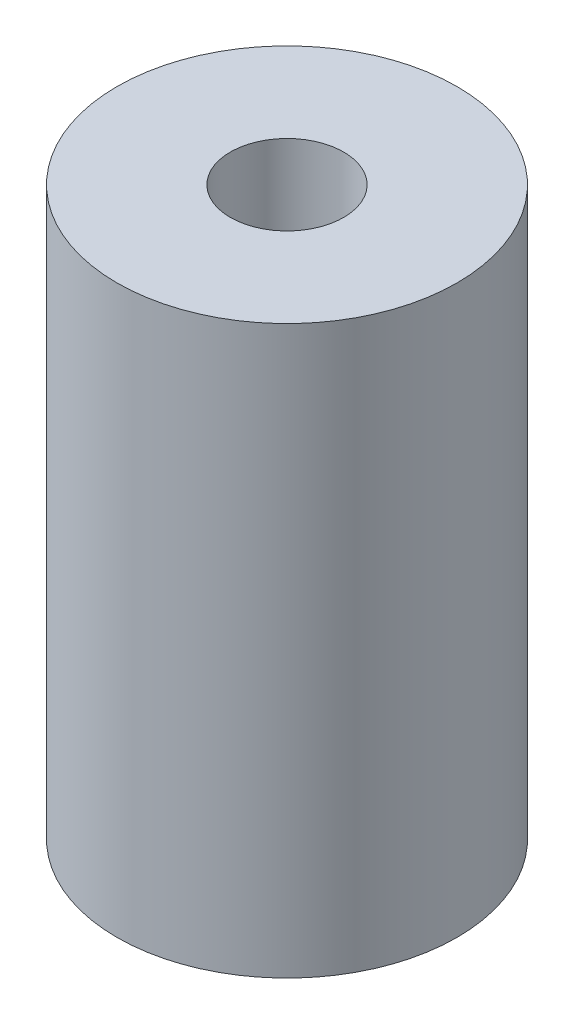
ISO-10303-21;
HEADER;
FILE_DESCRIPTION(('STEP AP214'),'2;1');
FILE_NAME('part.step','',(''),(''),'','','');
FILE_SCHEMA(('AUTOMOTIVE_DESIGN { 1 0 10303 214 1 1 1 1 }'));
ENDSEC;
DATA;
#1=APPLICATION_CONTEXT('core data for automotive mechanical design processes');
#2=APPLICATION_PROTOCOL_DEFINITION('international standard','automotive_design',2000,#1);
#3=PRODUCT_CONTEXT('',#1,'mechanical');
#4=PRODUCT('Part','Part','',(#3));
#5=PRODUCT_RELATED_PRODUCT_CATEGORY('part','',(#4));
#6=PRODUCT_DEFINITION_FORMATION('','',#4);
#7=PRODUCT_DEFINITION_CONTEXT('part definition',#1,'design');
#8=PRODUCT_DEFINITION('design','',#6,#7);
#9=PRODUCT_DEFINITION_SHAPE('','',#8);
#10=(LENGTH_UNIT() NAMED_UNIT(*) SI_UNIT(.MILLI.,.METRE.));
#11=(NAMED_UNIT(*) PLANE_ANGLE_UNIT() SI_UNIT($,.RADIAN.));
#12=(NAMED_UNIT(*) SI_UNIT($,.STERADIAN.) SOLID_ANGLE_UNIT());
#13=UNCERTAINTY_MEASURE_WITH_UNIT(LENGTH_MEASURE(1.E-05),#10,'distance_accuracy_value','');
#14=(GEOMETRIC_REPRESENTATION_CONTEXT(3) GLOBAL_UNCERTAINTY_ASSIGNED_CONTEXT((#13)) GLOBAL_UNIT_ASSIGNED_CONTEXT((#10,
#11,#12)) REPRESENTATION_CONTEXT('',''));
#15=CARTESIAN_POINT('',(0.,0.,0.));
#16=DIRECTION('',(0.,0.,1.));
#17=DIRECTION('',(1.,0.,0.));
#18=AXIS2_PLACEMENT_3D('',#15,#16,#17);
#19=CARTESIAN_POINT('',(0.,50.,0.));
#20=DIRECTION('',(0.,-1.,0.));
#21=DIRECTION('',(0.,0.,-1.));
#22=AXIS2_PLACEMENT_3D('',#19,#20,#21);
#23=CYLINDRICAL_SURFACE('',#22,15.);
#24=CARTESIAN_POINT('',(-14.142135623731,25.,5.));
#25=CARTESIAN_POINT('',(-14.1421347265217,24.7276591258196,5.00000128973856));
#26=CARTESIAN_POINT('',(-14.1500884645429,24.455326000882,4.97767391842761));
#27=CARTESIAN_POINT('',(-14.1808787040628,23.9187278950288,4.88925565844404));
#28=CARTESIAN_POINT('',(-14.2037176571094,23.6544642506377,4.82315756084198));
#29=CARTESIAN_POINT('',(-14.2614101844396,23.1418655350136,4.64977742842452));
#30=CARTESIAN_POINT('',(-14.2962401985661,22.8935003527864,4.54257610701622));
#31=CARTESIAN_POINT('',(-14.3739561005162,22.4181997572602,4.2903081422069));
#32=CARTESIAN_POINT('',(-14.4168437651806,22.1912690872318,4.14523314430091));
#33=CARTESIAN_POINT('',(-14.5077244703737,21.7564001883084,3.81525573221439));
#34=CARTESIAN_POINT('',(-14.5558447422322,21.5494228566414,3.62912170688959));
#35=CARTESIAN_POINT('',(-14.6506932400502,21.1689659938768,3.22493833607197));
#36=CARTESIAN_POINT('',(-14.6974212414481,20.9954918420882,3.00688387526187));
#37=CARTESIAN_POINT('',(-14.78569334609,20.682605513352,2.53802253982504));
#38=CARTESIAN_POINT('',(-14.8270703850803,20.5442001469102,2.28650955612262));
#39=CARTESIAN_POINT('',(-14.8984793385492,20.3120420743625,1.76215611493736));
#40=CARTESIAN_POINT('',(-14.9285143101501,20.2182773341155,1.48932142843605));
#41=CARTESIAN_POINT('',(-14.9729537715953,20.081320726838,0.940144087167467));
#42=CARTESIAN_POINT('',(-14.987865738878,20.036482768715,0.664253774264838));
#43=CARTESIAN_POINT('',(-15.0021804109124,19.9934185331967,0.108489374120443));
#44=CARTESIAN_POINT('',(-15.0015871131448,19.9951802417379,-0.171383667719486));
#45=CARTESIAN_POINT('',(-14.9853019809366,20.0442212728301,-0.715517575969077));
#46=CARTESIAN_POINT('',(-14.9702032377559,20.0897126423724,-0.979960242958287));
#47=CARTESIAN_POINT('',(-14.9273483669866,20.2219649049024,-1.49721719411086));
#48=CARTESIAN_POINT('',(-14.8995913815591,20.3087285948991,-1.75003068889608));
#49=CARTESIAN_POINT('',(-14.8337835146612,20.5221065865303,-2.24076237420987));
#50=CARTESIAN_POINT('',(-14.7956021262008,20.6492296927326,-2.47844110484423));
#51=CARTESIAN_POINT('',(-14.712919651946,20.9392985272433,-2.92962162763662));
#52=CARTESIAN_POINT('',(-14.6684168100733,21.1022542166382,-3.14311667192671));
#53=CARTESIAN_POINT('',(-14.5753095924948,21.4683719672985,-3.55050433275654));
#54=CARTESIAN_POINT('',(-14.5266107584439,21.6730657892074,-3.74300078532636));
#55=CARTESIAN_POINT('',(-14.432366762445,22.1122436286331,-4.09138629799087));
#56=CARTESIAN_POINT('',(-14.3868220872808,22.3467322286402,-4.24726971640772));
#57=CARTESIAN_POINT('',(-14.3035262560556,22.8432681280172,-4.51993727517872));
#58=CARTESIAN_POINT('',(-14.2658954642374,23.1056606565889,-4.6361323181067));
#59=CARTESIAN_POINT('',(-14.2040825412192,23.6478569710721,-4.82221596634669));
#60=CARTESIAN_POINT('',(-14.1798947743546,23.9276534060312,-4.89212397873747));
#61=CARTESIAN_POINT('',(-14.1489818157793,24.4831917770579,-4.98080641048761));
#62=CARTESIAN_POINT('',(-14.1415180159378,24.7585471237433,-5.00174547753817));
#63=CARTESIAN_POINT('',(-14.1428336029592,25.3088807455705,-4.9980271945486));
#64=CARTESIAN_POINT('',(-14.1516100395907,25.58385908012,-4.97337812613382));
#65=CARTESIAN_POINT('',(-14.183680904515,26.1157848285596,-4.88112825776155));
#66=CARTESIAN_POINT('',(-14.206466272042,26.3730271507542,-4.81503196990342));
#67=CARTESIAN_POINT('',(-14.2634276835512,26.8727180311959,-4.64356931280234));
#68=CARTESIAN_POINT('',(-14.297605746742,27.1151639579539,-4.53819598181711));
#69=CARTESIAN_POINT('',(-14.3748438797893,27.586902104235,-4.28737170369469));
#70=CARTESIAN_POINT('',(-14.4181512832814,27.815533213209,-4.14075559179249));
#71=CARTESIAN_POINT('',(-14.5082884365483,28.2457302619186,-3.81292815278779));
#72=CARTESIAN_POINT('',(-14.5551192221897,28.4472881933061,-3.63170662749391));
#73=CARTESIAN_POINT('',(-14.6497519318925,28.8276399204532,-3.22945852950163));
#74=CARTESIAN_POINT('',(-14.6974921788948,29.0048719500943,-3.00693635273326));
#75=CARTESIAN_POINT('',(-14.7863425806554,29.3195807117402,-2.53413645700129));
#76=CARTESIAN_POINT('',(-14.8274529708847,29.4570588558121,-2.28385972432276));
#77=CARTESIAN_POINT('',(-14.8982202905302,29.6871005243086,-1.76389931216148));
#78=CARTESIAN_POINT('',(-14.9279515002266,29.7799563857403,-1.49435561660598));
#79=CARTESIAN_POINT('',(-14.9729305418887,29.9186387103005,-0.942292329230082));
#80=CARTESIAN_POINT('',(-14.9881836017009,29.9644821494025,-0.659777459769447));
#81=CARTESIAN_POINT('',(-15.0020931618128,30.0063103880282,-0.104076679300205));
#82=CARTESIAN_POINT('',(-15.001496004472,30.0045372696619,0.168923619600093));
#83=CARTESIAN_POINT('',(-14.9856098259699,29.956713459268,0.710555725000869));
#84=CARTESIAN_POINT('',(-14.9703219966788,29.9106663592362,0.979187884095283));
#85=CARTESIAN_POINT('',(-14.9270457477206,29.7770888271202,1.50021059716029));
#86=CARTESIAN_POINT('',(-14.8992629180574,29.6902289232353,1.75279135456394));
#87=CARTESIAN_POINT('',(-14.8338580352248,29.4781123445142,2.23989175469898));
#88=CARTESIAN_POINT('',(-14.7962342024008,29.3528487240149,2.47440812071216));
#89=CARTESIAN_POINT('',(-14.7132934413941,29.06215243949,2.92817008154392));
#90=CARTESIAN_POINT('',(-14.6677436245963,28.8954065730918,3.14653125778803));
#91=CARTESIAN_POINT('',(-14.574649439594,28.528713044219,3.55290513136213));
#92=CARTESIAN_POINT('',(-14.5271044386549,28.3287547886864,3.74090810812296));
#93=CARTESIAN_POINT('',(-14.4331639912799,27.8919532220653,4.08870904416559));
#94=CARTESIAN_POINT('',(-14.3868863994315,27.6539724451168,4.2471148299895));
#95=CARTESIAN_POINT('',(-14.3030096661508,27.1533278654861,4.52157171650557));
#96=CARTESIAN_POINT('',(-14.2654082580625,26.8906705348517,4.63763388409737));
#97=CARTESIAN_POINT('',(-14.2050667103257,26.3601908799218,4.81921914102083));
#98=CARTESIAN_POINT('',(-14.1817316428591,26.0931386823732,4.8867895457476));
#99=CARTESIAN_POINT('',(-14.1502691769759,25.5507197476665,4.97717160074633));
#100=CARTESIAN_POINT('',(-14.1421365308731,25.2753559129465,4.99999869598296));
#101=CARTESIAN_POINT('',(-14.142135623731,25.,5.));
#102=B_SPLINE_CURVE_WITH_KNOTS('',3,(#24,#25,#26,#27,#28,#29,#30,#31,#32,#33,#34,#35,#36,#37,
#38,#39,#40,#41,#42,#43,#44,#45,#46,#47,#48,#49,#50,#51,#52,#53,#54,#55,#56,#57,#58,#59,#60,#61,
#62,#63,#64,#65,#66,#67,#68,#69,#70,#71,#72,#73,#74,#75,#76,#77,#78,#79,#80,#81,#82,#83,#84,#85,
#86,#87,#88,#89,#90,#91,#92,#93,#94,#95,#96,#97,#98,#99,#100,#101),.UNSPECIFIED.,.T.,.F.,(4,2,2,
2,2,2,2,2,2,2,2,2,2,2,2,2,2,2,2,2,2,2,2,2,2,2,2,2,2,2,2,2,2,2,2,2,2,2,4),(0.,0.816002923996784,
1.63214027507582,2.44668313750414,3.26140583092721,4.10506687137841,4.9488632585994,
5.81467530718286,6.68025381933945,7.51571593824671,8.35096266511636,9.15345024127845,
9.95599220946183,10.7690827430167,11.5823995937011,12.4340087181959,13.2857489806053,
14.1496319921528,15.0131525678308,15.837714568222,16.6621267918617,17.4582197884388,
18.2544539573473,19.0759428867857,19.8976742831064,20.7589404085546,21.6201759378766,
22.4756895595426,23.3308941502078,24.1459042338818,24.9608482004891,25.7628478020215,
26.5649925381621,27.3967759760317,28.2288252216316,29.0934451368072,29.9578389133433,
30.7831606081345,31.6081973595232),.UNSPECIFIED.);
#103=CARTESIAN_POINT('',(-14.142135623731,25.,5.));
#104=VERTEX_POINT('',#103);
#105=EDGE_CURVE('E35',#104,#104,#102,.T.);
#106=ORIENTED_EDGE('',*,*,#105,.T.);
#107=EDGE_LOOP('',(#106));
#108=FACE_BOUND('',#107,.T.);
#109=CARTESIAN_POINT('',(0.,50.,0.));
#110=DIRECTION('',(0.,1.,0.));
#111=DIRECTION('',(0.,0.,1.));
#112=AXIS2_PLACEMENT_3D('',#109,#110,#111);
#113=CIRCLE('',#112,15.);
#114=CARTESIAN_POINT('',(0.,50.,15.));
#115=VERTEX_POINT('',#114);
#116=EDGE_CURVE('E10',#115,#115,#113,.T.);
#117=ORIENTED_EDGE('',*,*,#116,.F.);
#118=EDGE_LOOP('',(#117));
#119=FACE_BOUND('',#118,.T.);
#120=CARTESIAN_POINT('',(0.,0.,0.));
#121=DIRECTION('',(0.,1.,0.));
#122=DIRECTION('',(0.,0.,1.));
#123=AXIS2_PLACEMENT_3D('',#120,#121,#122);
#124=CIRCLE('',#123,15.);
#125=CARTESIAN_POINT('',(0.,0.,15.));
#126=VERTEX_POINT('',#125);
#127=EDGE_CURVE('E42',#126,#126,#124,.T.);
#128=ORIENTED_EDGE('',*,*,#127,.T.);
#129=EDGE_LOOP('',(#128));
#130=FACE_BOUND('',#129,.T.);
#131=ADVANCED_FACE('F31',(#108,#119,#130),#23,.T.);
#132=CARTESIAN_POINT('',(0.,50.,0.));
#133=DIRECTION('',(0.,1.,0.));
#134=DIRECTION('',(0.,0.,1.));
#135=AXIS2_PLACEMENT_3D('',#132,#133,#134);
#136=PLANE('',#135);
#137=CARTESIAN_POINT('',(0.,50.,0.));
#138=DIRECTION('',(0.,1.,0.));
#139=DIRECTION('',(0.,0.,1.));
#140=AXIS2_PLACEMENT_3D('',#137,#138,#139);
#141=CIRCLE('',#140,5.);
#142=CARTESIAN_POINT('',(0.,50.,5.));
#143=VERTEX_POINT('',#142);
#144=EDGE_CURVE('E52',#143,#143,#141,.T.);
#145=ORIENTED_EDGE('',*,*,#144,.F.);
#146=EDGE_LOOP('',(#145));
#147=FACE_BOUND('',#146,.T.);
#148=ORIENTED_EDGE('',*,*,#116,.T.);
#149=EDGE_LOOP('',(#148));
#150=FACE_BOUND('',#149,.T.);
#151=ADVANCED_FACE('F67',(#147,#150),#136,.T.);
#152=CARTESIAN_POINT('',(0.,0.,0.));
#153=DIRECTION('',(0.,1.,0.));
#154=DIRECTION('',(0.,0.,1.));
#155=AXIS2_PLACEMENT_3D('',#152,#153,#154);
#156=PLANE('',#155);
#157=ORIENTED_EDGE('',*,*,#127,.F.);
#158=EDGE_LOOP('',(#157));
#159=FACE_BOUND('',#158,.T.);
#160=ADVANCED_FACE('F69',(#159),#156,.F.);
#161=CARTESIAN_POINT('',(-5.,25.,0.));
#162=DIRECTION('',(-1.,0.,0.));
#163=DIRECTION('',(0.,0.,1.));
#164=AXIS2_PLACEMENT_3D('',#161,#162,#163);
#165=CYLINDRICAL_SURFACE('',#164,5.);
#166=CARTESIAN_POINT('',(-5.,25.,0.));
#167=DIRECTION('',(-1.,0.,0.));
#168=DIRECTION('',(0.,0.,1.));
#169=AXIS2_PLACEMENT_3D('',#166,#167,#168);
#170=CIRCLE('',#169,5.);
#171=CARTESIAN_POINT('',(-5.,25.,5.));
#172=VERTEX_POINT('',#171);
#173=EDGE_CURVE('E48',#172,#172,#170,.T.);
#174=ORIENTED_EDGE('',*,*,#173,.F.);
#175=EDGE_LOOP('',(#174));
#176=FACE_BOUND('',#175,.T.);
#177=ORIENTED_EDGE('',*,*,#105,.F.);
#178=EDGE_LOOP('',(#177));
#179=FACE_BOUND('',#178,.T.);
#180=ADVANCED_FACE('F75',(#176,#179),#165,.F.);
#181=CARTESIAN_POINT('',(-5.,25.,0.));
#182=DIRECTION('',(-1.,0.,0.));
#183=DIRECTION('',(0.,0.,1.));
#184=AXIS2_PLACEMENT_3D('',#181,#182,#183);
#185=PLANE('',#184);
#186=ORIENTED_EDGE('',*,*,#173,.T.);
#187=EDGE_LOOP('',(#186));
#188=FACE_BOUND('',#187,.T.);
#189=ADVANCED_FACE('F63',(#188),#185,.T.);
#190=CARTESIAN_POINT('',(0.,40.,0.));
#191=DIRECTION('',(0.,1.,0.));
#192=DIRECTION('',(0.,0.,1.));
#193=AXIS2_PLACEMENT_3D('',#190,#191,#192);
#194=CYLINDRICAL_SURFACE('',#193,5.);
#195=CARTESIAN_POINT('',(0.,40.,0.));
#196=DIRECTION('',(0.,1.,0.));
#197=DIRECTION('',(0.,0.,1.));
#198=AXIS2_PLACEMENT_3D('',#195,#196,#197);
#199=CIRCLE('',#198,5.);
#200=CARTESIAN_POINT('',(0.,40.,5.));
#201=VERTEX_POINT('',#200);
#202=EDGE_CURVE('E51',#201,#201,#199,.T.);
#203=ORIENTED_EDGE('',*,*,#202,.F.);
#204=EDGE_LOOP('',(#203));
#205=FACE_BOUND('',#204,.T.);
#206=ORIENTED_EDGE('',*,*,#144,.T.);
#207=EDGE_LOOP('',(#206));
#208=FACE_BOUND('',#207,.T.);
#209=ADVANCED_FACE('F60',(#205,#208),#194,.F.);
#210=CARTESIAN_POINT('',(0.,40.,0.));
#211=DIRECTION('',(0.,1.,0.));
#212=DIRECTION('',(0.,0.,1.));
#213=AXIS2_PLACEMENT_3D('',#210,#211,#212);
#214=PLANE('',#213);
#215=ORIENTED_EDGE('',*,*,#202,.T.);
#216=EDGE_LOOP('',(#215));
#217=FACE_BOUND('',#216,.T.);
#218=ADVANCED_FACE('F58',(#217),#214,.T.);
#219=CLOSED_SHELL('',(#131,#151,#160,#180,#189,#209,#218));
#220=MANIFOLD_SOLID_BREP('B2',#219);
#221=ADVANCED_BREP_SHAPE_REPRESENTATION('',(#18,#220),#14);
#222=SHAPE_DEFINITION_REPRESENTATION(#9,#221);
ENDSEC;
END-ISO-10303-21;
